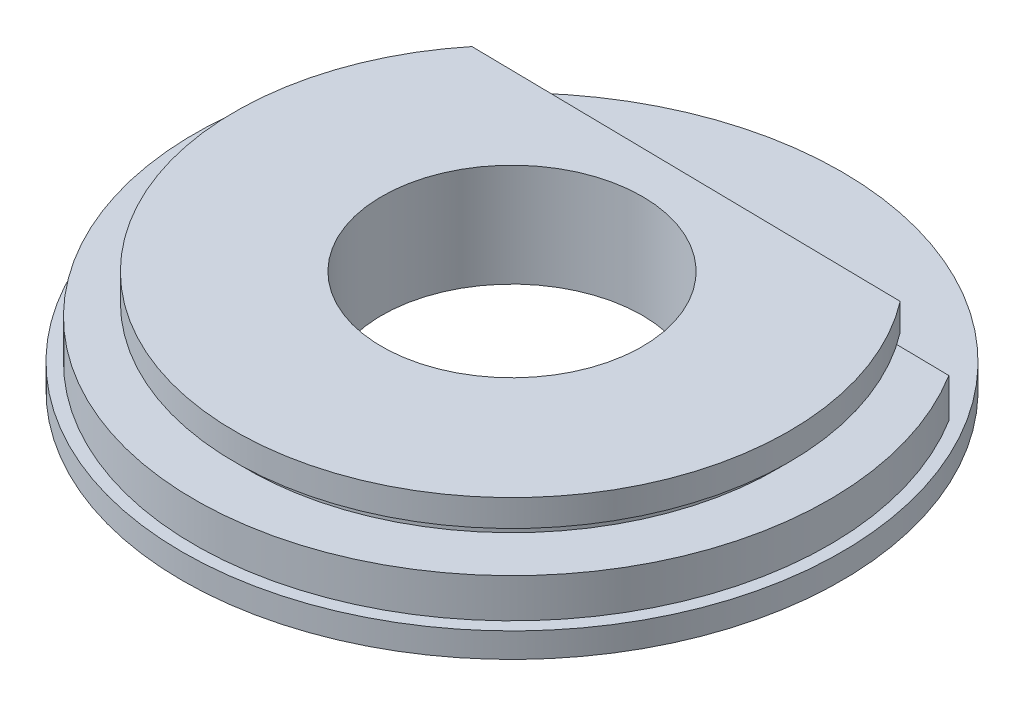
ISO-10303-21;
HEADER;
FILE_DESCRIPTION(('STEP AP214'),'2;1');
FILE_NAME('part.step','',(''),(''),'','','');
FILE_SCHEMA(('AUTOMOTIVE_DESIGN { 1 0 10303 214 1 1 1 1 }'));
ENDSEC;
DATA;
#1=APPLICATION_CONTEXT('core data for automotive mechanical design processes');
#2=APPLICATION_PROTOCOL_DEFINITION('international standard','automotive_design',2000,#1);
#3=PRODUCT_CONTEXT('',#1,'mechanical');
#4=PRODUCT('Part','Part','',(#3));
#5=PRODUCT_RELATED_PRODUCT_CATEGORY('part','',(#4));
#6=PRODUCT_DEFINITION_FORMATION('','',#4);
#7=PRODUCT_DEFINITION_CONTEXT('part definition',#1,'design');
#8=PRODUCT_DEFINITION('design','',#6,#7);
#9=PRODUCT_DEFINITION_SHAPE('','',#8);
#10=(LENGTH_UNIT() NAMED_UNIT(*) SI_UNIT(.MILLI.,.METRE.));
#11=(NAMED_UNIT(*) PLANE_ANGLE_UNIT() SI_UNIT($,.RADIAN.));
#12=(NAMED_UNIT(*) SI_UNIT($,.STERADIAN.) SOLID_ANGLE_UNIT());
#13=UNCERTAINTY_MEASURE_WITH_UNIT(LENGTH_MEASURE(1.E-05),#10,'distance_accuracy_value','');
#14=(GEOMETRIC_REPRESENTATION_CONTEXT(3) GLOBAL_UNCERTAINTY_ASSIGNED_CONTEXT((#13)) GLOBAL_UNIT_ASSIGNED_CONTEXT((#10,
#11,#12)) REPRESENTATION_CONTEXT('',''));
#15=CARTESIAN_POINT('',(0.,0.,0.));
#16=DIRECTION('',(0.,0.,1.));
#17=DIRECTION('',(1.,0.,0.));
#18=AXIS2_PLACEMENT_3D('',#15,#16,#17);
#19=CARTESIAN_POINT('',(0.,0.,0.));
#20=DIRECTION('',(0.,-1.,0.));
#21=DIRECTION('',(0.,0.,-1.));
#22=AXIS2_PLACEMENT_3D('',#19,#20,#21);
#23=CYLINDRICAL_SURFACE('',#22,40.);
#24=CARTESIAN_POINT('',(0.,3.,0.));
#25=DIRECTION('',(0.,-1.,0.));
#26=DIRECTION('',(0.,0.,-1.));
#27=AXIS2_PLACEMENT_3D('',#24,#25,#26);
#28=CIRCLE('',#27,40.);
#29=CARTESIAN_POINT('',(0.,3.,-40.));
#30=VERTEX_POINT('',#29);
#31=EDGE_CURVE('E51',#30,#30,#28,.T.);
#32=ORIENTED_EDGE('',*,*,#31,.T.);
#33=EDGE_LOOP('',(#32));
#34=FACE_BOUND('',#33,.T.);
#35=CARTESIAN_POINT('',(0.,0.,0.));
#36=DIRECTION('',(0.,-1.,0.));
#37=DIRECTION('',(0.,0.,-1.));
#38=AXIS2_PLACEMENT_3D('',#35,#36,#37);
#39=CIRCLE('',#38,40.);
#40=CARTESIAN_POINT('',(0.,0.,-40.));
#41=VERTEX_POINT('',#40);
#42=EDGE_CURVE('E147',#41,#41,#39,.T.);
#43=ORIENTED_EDGE('',*,*,#42,.F.);
#44=EDGE_LOOP('',(#43));
#45=FACE_BOUND('',#44,.T.);
#46=ADVANCED_FACE('F43',(#34,#45),#23,.T.);
#47=CARTESIAN_POINT('',(40.,3.,0.));
#48=DIRECTION('',(0.,1.,0.));
#49=DIRECTION('',(0.,0.,1.));
#50=AXIS2_PLACEMENT_3D('',#47,#48,#49);
#51=PLANE('',#50);
#52=CARTESIAN_POINT('',(0.,3.,0.));
#53=DIRECTION('',(0.,-1.,0.));
#54=DIRECTION('',(0.,0.,-1.));
#55=AXIS2_PLACEMENT_3D('',#52,#53,#54);
#56=CIRCLE('',#55,38.5);
#57=CARTESIAN_POINT('',(32.6966084044568,3.,-20.3268738089654));
#58=VERTEX_POINT('',#57);
#59=CARTESIAN_POINT('',(-32.0672312296887,3.,-21.3059306593653));
#60=VERTEX_POINT('',#59);
#61=EDGE_CURVE('E110',#58,#60,#56,.T.);
#62=ORIENTED_EDGE('',*,*,#61,.T.);
#63=DIRECTION('',(-0.999885752628396,0.,-0.0151156108294093));
#64=VECTOR('',#63,1.);
#65=CARTESIAN_POINT('',(-32.0672312296887,3.,-21.3059306593653));
#66=LINE('',#65,#64);
#67=EDGE_CURVE('E95',#58,#60,#66,.T.);
#68=ORIENTED_EDGE('',*,*,#67,.F.);
#69=EDGE_LOOP('',(#62,#68));
#70=FACE_BOUND('',#69,.T.);
#71=ORIENTED_EDGE('',*,*,#31,.F.);
#72=EDGE_LOOP('',(#71));
#73=FACE_BOUND('',#72,.T.);
#74=ADVANCED_FACE('F108',(#70,#73),#51,.T.);
#75=CARTESIAN_POINT('',(0.,0.,0.));
#76=DIRECTION('',(0.,-1.,0.));
#77=DIRECTION('',(0.,0.,-1.));
#78=AXIS2_PLACEMENT_3D('',#75,#76,#77);
#79=CYLINDRICAL_SURFACE('',#78,38.5);
#80=DIRECTION('',(0.,1.,0.));
#81=VECTOR('',#80,1.);
#82=CARTESIAN_POINT('',(-32.0672312296887,-64.2652766270427,-21.3059306593653));
#83=LINE('',#82,#81);
#84=CARTESIAN_POINT('',(-32.0672312296887,7.74999999999999,-21.3059306593653));
#85=VERTEX_POINT('',#84);
#86=EDGE_CURVE('E104',#60,#85,#83,.T.);
#87=ORIENTED_EDGE('',*,*,#86,.F.);
#88=ORIENTED_EDGE('',*,*,#61,.F.);
#89=DIRECTION('',(0.,1.,0.));
#90=VECTOR('',#89,1.);
#91=CARTESIAN_POINT('',(32.6966084044568,-64.2652766270427,-20.3268738089654));
#92=LINE('',#91,#90);
#93=CARTESIAN_POINT('',(32.6966084044568,7.74999999999999,-20.3268738089654));
#94=VERTEX_POINT('',#93);
#95=EDGE_CURVE('E92',#58,#94,#92,.T.);
#96=ORIENTED_EDGE('',*,*,#95,.T.);
#97=CARTESIAN_POINT('',(0.,7.75,0.));
#98=DIRECTION('',(0.,-1.,0.));
#99=DIRECTION('',(0.,0.,-1.));
#100=AXIS2_PLACEMENT_3D('',#97,#98,#99);
#101=CIRCLE('',#100,38.5);
#102=EDGE_CURVE('E116',#94,#85,#101,.T.);
#103=ORIENTED_EDGE('',*,*,#102,.T.);
#104=EDGE_LOOP('',(#87,#88,#96,#103));
#105=FACE_BOUND('',#104,.T.);
#106=ADVANCED_FACE('F114',(#105),#79,.T.);
#107=CARTESIAN_POINT('',(38.5,7.75,0.));
#108=DIRECTION('',(0.,1.,0.));
#109=DIRECTION('',(0.,0.,1.));
#110=AXIS2_PLACEMENT_3D('',#107,#108,#109);
#111=PLANE('',#110);
#112=DIRECTION('',(0.999885752628396,0.,0.0151156108294093));
#113=VECTOR('',#112,1.);
#114=CARTESIAN_POINT('',(38.8058920422903,7.75,-20.2345177036072));
#115=LINE('',#114,#113);
#116=CARTESIAN_POINT('',(-24.133564572458,7.75,-21.1859947393607));
#117=VERTEX_POINT('',#116);
#118=EDGE_CURVE('E64',#85,#117,#115,.T.);
#119=ORIENTED_EDGE('',*,*,#118,.F.);
#120=ORIENTED_EDGE('',*,*,#102,.F.);
#121=CARTESIAN_POINT('',(24.7629417472261,7.75,-20.44680972897));
#122=VERTEX_POINT('',#121);
#123=EDGE_CURVE('E98',#122,#94,#115,.T.);
#124=ORIENTED_EDGE('',*,*,#123,.F.);
#125=CARTESIAN_POINT('',(0.,7.75,0.));
#126=DIRECTION('',(0.,-1.,0.));
#127=DIRECTION('',(0.,0.,-1.));
#128=AXIS2_PLACEMENT_3D('',#125,#126,#127);
#129=CIRCLE('',#128,32.1134755526277);
#130=EDGE_CURVE('E121',#122,#117,#129,.T.);
#131=ORIENTED_EDGE('',*,*,#130,.T.);
#132=EDGE_LOOP('',(#119,#120,#124,#131));
#133=FACE_BOUND('',#132,.T.);
#134=ADVANCED_FACE('F169',(#133),#111,.T.);
#135=CARTESIAN_POINT('',(0.,0.,0.));
#136=DIRECTION('',(0.,-1.,0.));
#137=DIRECTION('',(0.,0.,-1.));
#138=AXIS2_PLACEMENT_3D('',#135,#136,#137);
#139=CYLINDRICAL_SURFACE('',#138,32.1134755526277);
#140=DIRECTION('',(0.,-1.,0.));
#141=VECTOR('',#140,1.);
#142=CARTESIAN_POINT('',(-24.133564572458,0.,-21.1859947393607));
#143=LINE('',#142,#141);
#144=CARTESIAN_POINT('',(-24.133564572458,9.25,-21.1859947393607));
#145=VERTEX_POINT('',#144);
#146=EDGE_CURVE('E151',#117,#145,#143,.F.);
#147=ORIENTED_EDGE('',*,*,#146,.F.);
#148=ORIENTED_EDGE('',*,*,#130,.F.);
#149=DIRECTION('',(0.,-1.,0.));
#150=VECTOR('',#149,1.);
#151=CARTESIAN_POINT('',(24.7629417472261,0.,-20.44680972897));
#152=LINE('',#151,#150);
#153=CARTESIAN_POINT('',(24.7629417472261,9.25,-20.44680972897));
#154=VERTEX_POINT('',#153);
#155=EDGE_CURVE('E159',#154,#122,#152,.T.);
#156=ORIENTED_EDGE('',*,*,#155,.F.);
#157=CARTESIAN_POINT('',(0.,9.25,0.));
#158=DIRECTION('',(0.,-1.,0.));
#159=DIRECTION('',(0.,0.,-1.));
#160=AXIS2_PLACEMENT_3D('',#157,#158,#159);
#161=CIRCLE('',#160,32.1134755526277);
#162=EDGE_CURVE('E127',#154,#145,#161,.T.);
#163=ORIENTED_EDGE('',*,*,#162,.T.);
#164=EDGE_LOOP('',(#147,#148,#156,#163));
#165=FACE_BOUND('',#164,.T.);
#166=ADVANCED_FACE('F185',(#165),#139,.T.);
#167=CARTESIAN_POINT('',(32.1134755526277,9.25,0.));
#168=DIRECTION('',(0.,-1.,0.));
#169=DIRECTION('',(0.,0.,-1.));
#170=AXIS2_PLACEMENT_3D('',#167,#168,#169);
#171=PLANE('',#170);
#172=DIRECTION('',(-0.999885752628396,0.,-0.0151156108294093));
#173=VECTOR('',#172,1.);
#174=CARTESIAN_POINT('',(32.4208267988218,9.25,-20.331042892697));
#175=LINE('',#174,#173);
#176=CARTESIAN_POINT('',(26.7019010797683,9.25,-20.4174978254773));
#177=VERTEX_POINT('',#176);
#178=EDGE_CURVE('E162',#177,#154,#175,.T.);
#179=ORIENTED_EDGE('',*,*,#178,.F.);
#180=CARTESIAN_POINT('',(0.,9.25,0.));
#181=DIRECTION('',(0.,-1.,0.));
#182=DIRECTION('',(0.,0.,-1.));
#183=AXIS2_PLACEMENT_3D('',#180,#181,#182);
#184=CIRCLE('',#183,33.6134755526277);
#185=CARTESIAN_POINT('',(-26.0725239050001,9.25,-21.2153066428534));
#186=VERTEX_POINT('',#185);
#187=EDGE_CURVE('E131',#177,#186,#184,.T.);
#188=ORIENTED_EDGE('',*,*,#187,.T.);
#189=EDGE_CURVE('E154',#145,#186,#175,.T.);
#190=ORIENTED_EDGE('',*,*,#189,.F.);
#191=ORIENTED_EDGE('',*,*,#162,.F.);
#192=EDGE_LOOP('',(#179,#188,#190,#191));
#193=FACE_BOUND('',#192,.T.);
#194=ADVANCED_FACE('F182',(#193),#171,.T.);
#195=CARTESIAN_POINT('',(0.,0.,0.));
#196=DIRECTION('',(0.,-1.,0.));
#197=DIRECTION('',(0.,0.,-1.));
#198=AXIS2_PLACEMENT_3D('',#195,#196,#197);
#199=CYLINDRICAL_SURFACE('',#198,33.6134755526277);
#200=DIRECTION('',(0.,-1.,0.));
#201=VECTOR('',#200,1.);
#202=CARTESIAN_POINT('',(-26.0725239050001,0.,-21.2153066428534));
#203=LINE('',#202,#201);
#204=CARTESIAN_POINT('',(-26.0725239050001,12.5,-21.2153066428534));
#205=VERTEX_POINT('',#204);
#206=EDGE_CURVE('E57',#186,#205,#203,.F.);
#207=ORIENTED_EDGE('',*,*,#206,.F.);
#208=ORIENTED_EDGE('',*,*,#187,.F.);
#209=DIRECTION('',(0.,-1.,0.));
#210=VECTOR('',#209,1.);
#211=CARTESIAN_POINT('',(26.7019010797683,0.,-20.4174978254773));
#212=LINE('',#211,#210);
#213=CARTESIAN_POINT('',(26.7019010797683,12.5,-20.4174978254773));
#214=VERTEX_POINT('',#213);
#215=EDGE_CURVE('E112',#214,#177,#212,.T.);
#216=ORIENTED_EDGE('',*,*,#215,.F.);
#217=CARTESIAN_POINT('',(0.,12.5,0.));
#218=DIRECTION('',(0.,-1.,0.));
#219=DIRECTION('',(0.,0.,-1.));
#220=AXIS2_PLACEMENT_3D('',#217,#218,#219);
#221=CIRCLE('',#220,33.6134755526277);
#222=EDGE_CURVE('E135',#214,#205,#221,.T.);
#223=ORIENTED_EDGE('',*,*,#222,.T.);
#224=EDGE_LOOP('',(#207,#208,#216,#223));
#225=FACE_BOUND('',#224,.T.);
#226=ADVANCED_FACE('F178',(#225),#199,.T.);
#227=CARTESIAN_POINT('',(33.6134755526277,12.5,0.));
#228=DIRECTION('',(0.,1.,0.));
#229=DIRECTION('',(0.,0.,1.));
#230=AXIS2_PLACEMENT_3D('',#227,#228,#229);
#231=PLANE('',#230);
#232=DIRECTION('',(0.999885752628396,0.,0.0151156108294093));
#233=VECTOR('',#232,1.);
#234=CARTESIAN_POINT('',(33.9204840762857,12.5,-20.3083720668311));
#235=LINE('',#234,#233);
#236=EDGE_CURVE('E11',#205,#214,#235,.T.);
#237=ORIENTED_EDGE('',*,*,#236,.F.);
#238=ORIENTED_EDGE('',*,*,#222,.F.);
#239=EDGE_LOOP('',(#237,#238));
#240=FACE_BOUND('',#239,.T.);
#241=CARTESIAN_POINT('',(0.,12.5,0.));
#242=DIRECTION('',(0.,-1.,0.));
#243=DIRECTION('',(0.,0.,-1.));
#244=AXIS2_PLACEMENT_3D('',#241,#242,#243);
#245=CIRCLE('',#244,15.8025896481624);
#246=CARTESIAN_POINT('',(0.,12.5,-15.8025896481624));
#247=VERTEX_POINT('',#246);
#248=EDGE_CURVE('E139',#247,#247,#245,.T.);
#249=ORIENTED_EDGE('',*,*,#248,.T.);
#250=EDGE_LOOP('',(#249));
#251=FACE_BOUND('',#250,.T.);
#252=ADVANCED_FACE('F212',(#240,#251),#231,.T.);
#253=CARTESIAN_POINT('',(0.,0.,0.));
#254=DIRECTION('',(0.,-1.,0.));
#255=DIRECTION('',(0.,0.,-1.));
#256=AXIS2_PLACEMENT_3D('',#253,#254,#255);
#257=CYLINDRICAL_SURFACE('',#256,15.8025896481624);
#258=CARTESIAN_POINT('',(0.,0.,0.));
#259=DIRECTION('',(0.,-1.,0.));
#260=DIRECTION('',(0.,0.,-1.));
#261=AXIS2_PLACEMENT_3D('',#258,#259,#260);
#262=CIRCLE('',#261,15.8025896481624);
#263=CARTESIAN_POINT('',(0.,0.,-15.8025896481624));
#264=VERTEX_POINT('',#263);
#265=EDGE_CURVE('E143',#264,#264,#262,.T.);
#266=ORIENTED_EDGE('',*,*,#265,.T.);
#267=EDGE_LOOP('',(#266));
#268=FACE_BOUND('',#267,.T.);
#269=ORIENTED_EDGE('',*,*,#248,.F.);
#270=EDGE_LOOP('',(#269));
#271=FACE_BOUND('',#270,.T.);
#272=ADVANCED_FACE('F206',(#268,#271),#257,.F.);
#273=CARTESIAN_POINT('',(15.8025896481624,0.,0.));
#274=DIRECTION('',(0.,-1.,0.));
#275=DIRECTION('',(0.,0.,-1.));
#276=AXIS2_PLACEMENT_3D('',#273,#274,#275);
#277=PLANE('',#276);
#278=ORIENTED_EDGE('',*,*,#42,.T.);
#279=EDGE_LOOP('',(#278));
#280=FACE_BOUND('',#279,.T.);
#281=ORIENTED_EDGE('',*,*,#265,.F.);
#282=EDGE_LOOP('',(#281));
#283=FACE_BOUND('',#282,.T.);
#284=ADVANCED_FACE('F203',(#280,#283),#277,.T.);
#285=CARTESIAN_POINT('',(-32.0672312296887,-64.2652766270427,-21.3059306593653));
#286=DIRECTION('',(-0.0151156108294093,0.,0.999885752628396));
#287=DIRECTION('',(0.999885752628396,0.,0.0151156108294093));
#288=AXIS2_PLACEMENT_3D('',#285,#286,#287);
#289=PLANE('',#288);
#290=ORIENTED_EDGE('',*,*,#118,.T.);
#291=ORIENTED_EDGE('',*,*,#146,.T.);
#292=ORIENTED_EDGE('',*,*,#189,.T.);
#293=ORIENTED_EDGE('',*,*,#206,.T.);
#294=ORIENTED_EDGE('',*,*,#236,.T.);
#295=ORIENTED_EDGE('',*,*,#215,.T.);
#296=ORIENTED_EDGE('',*,*,#178,.T.);
#297=ORIENTED_EDGE('',*,*,#155,.T.);
#298=ORIENTED_EDGE('',*,*,#123,.T.);
#299=ORIENTED_EDGE('',*,*,#95,.F.);
#300=ORIENTED_EDGE('',*,*,#67,.T.);
#301=ORIENTED_EDGE('',*,*,#86,.T.);
#302=EDGE_LOOP('',(#290,#291,#292,#293,#294,#295,#296,#297,#298,#299,#300,#301));
#303=FACE_BOUND('',#302,.T.);
#304=ADVANCED_FACE('F94',(#303),#289,.F.);
#305=CLOSED_SHELL('',(#46,#74,#106,#134,#166,#194,#226,#252,#272,#284,#304));
#306=MANIFOLD_SOLID_BREP('B2',#305);
#307=ADVANCED_BREP_SHAPE_REPRESENTATION('',(#18,#306),#14);
#308=SHAPE_DEFINITION_REPRESENTATION(#9,#307);
ENDSEC;
END-ISO-10303-21;
